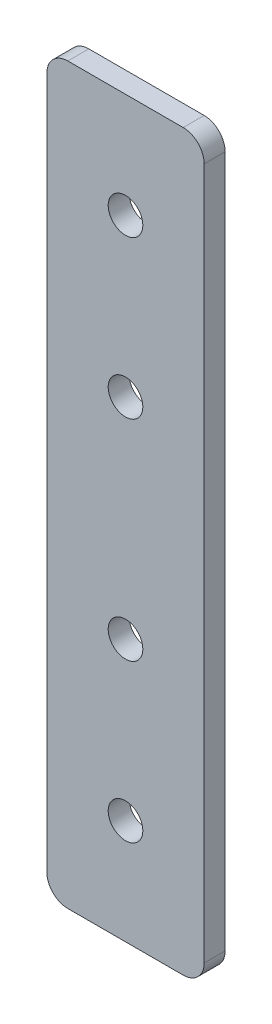
ISO-10303-21;
HEADER;
FILE_DESCRIPTION(('STEP AP214'),'2;1');
FILE_NAME('part.step','',(''),(''),'','','');
FILE_SCHEMA(('AUTOMOTIVE_DESIGN { 1 0 10303 214 1 1 1 1 }'));
ENDSEC;
DATA;
#1=APPLICATION_CONTEXT('core data for automotive mechanical design processes');
#2=APPLICATION_PROTOCOL_DEFINITION('international standard','automotive_design',2000,#1);
#3=PRODUCT_CONTEXT('',#1,'mechanical');
#4=PRODUCT('Part','Part','',(#3));
#5=PRODUCT_RELATED_PRODUCT_CATEGORY('part','',(#4));
#6=PRODUCT_DEFINITION_FORMATION('','',#4);
#7=PRODUCT_DEFINITION_CONTEXT('part definition',#1,'design');
#8=PRODUCT_DEFINITION('design','',#6,#7);
#9=PRODUCT_DEFINITION_SHAPE('','',#8);
#10=(LENGTH_UNIT() NAMED_UNIT(*) SI_UNIT(.MILLI.,.METRE.));
#11=(NAMED_UNIT(*) PLANE_ANGLE_UNIT() SI_UNIT($,.RADIAN.));
#12=(NAMED_UNIT(*) SI_UNIT($,.STERADIAN.) SOLID_ANGLE_UNIT());
#13=UNCERTAINTY_MEASURE_WITH_UNIT(LENGTH_MEASURE(1.E-05),#10,'distance_accuracy_value','');
#14=(GEOMETRIC_REPRESENTATION_CONTEXT(3) GLOBAL_UNCERTAINTY_ASSIGNED_CONTEXT((#13)) GLOBAL_UNIT_ASSIGNED_CONTEXT((#10,
#11,#12)) REPRESENTATION_CONTEXT('',''));
#15=CARTESIAN_POINT('',(0.,0.,0.));
#16=DIRECTION('',(0.,0.,1.));
#17=DIRECTION('',(1.,0.,0.));
#18=AXIS2_PLACEMENT_3D('',#15,#16,#17);
#19=CARTESIAN_POINT('',(7.5,-35.,2.));
#20=DIRECTION('',(-1.,0.,0.));
#21=DIRECTION('',(0.,0.,1.));
#22=AXIS2_PLACEMENT_3D('',#19,#20,#21);
#23=PLANE('',#22);
#24=DIRECTION('',(0.,1.,0.));
#25=VECTOR('',#24,1.);
#26=CARTESIAN_POINT('',(7.5,-35.,2.));
#27=LINE('',#26,#25);
#28=CARTESIAN_POINT('',(7.5,-33.,2.));
#29=VERTEX_POINT('',#28);
#30=CARTESIAN_POINT('',(7.5,33.,2.));
#31=VERTEX_POINT('',#30);
#32=EDGE_CURVE('E129',#29,#31,#27,.T.);
#33=ORIENTED_EDGE('',*,*,#32,.F.);
#34=DIRECTION('',(0.,0.,-1.));
#35=VECTOR('',#34,1.);
#36=CARTESIAN_POINT('',(7.5,-33.,2.));
#37=LINE('',#36,#35);
#38=CARTESIAN_POINT('',(7.5,-33.,0.));
#39=VERTEX_POINT('',#38);
#40=EDGE_CURVE('E155',#29,#39,#37,.T.);
#41=ORIENTED_EDGE('',*,*,#40,.T.);
#42=DIRECTION('',(0.,1.,0.));
#43=VECTOR('',#42,1.);
#44=CARTESIAN_POINT('',(7.5,-35.,0.));
#45=LINE('',#44,#43);
#46=CARTESIAN_POINT('',(7.5,33.,0.));
#47=VERTEX_POINT('',#46);
#48=EDGE_CURVE('E163',#39,#47,#45,.T.);
#49=ORIENTED_EDGE('',*,*,#48,.T.);
#50=DIRECTION('',(0.,0.,-1.));
#51=VECTOR('',#50,1.);
#52=CARTESIAN_POINT('',(7.5,33.,2.));
#53=LINE('',#52,#51);
#54=EDGE_CURVE('E153',#47,#31,#53,.F.);
#55=ORIENTED_EDGE('',*,*,#54,.T.);
#56=EDGE_LOOP('',(#33,#41,#49,#55));
#57=FACE_BOUND('',#56,.T.);
#58=ADVANCED_FACE('F38',(#57),#23,.F.);
#59=CARTESIAN_POINT('',(-7.5,35.,2.));
#60=DIRECTION('',(0.,-1.,0.));
#61=DIRECTION('',(0.,0.,-1.));
#62=AXIS2_PLACEMENT_3D('',#59,#60,#61);
#63=PLANE('',#62);
#64=DIRECTION('',(-1.,0.,0.));
#65=VECTOR('',#64,1.);
#66=CARTESIAN_POINT('',(-7.5,35.,0.));
#67=LINE('',#66,#65);
#68=CARTESIAN_POINT('',(5.5,35.,0.));
#69=VERTEX_POINT('',#68);
#70=CARTESIAN_POINT('',(-5.5,35.,0.));
#71=VERTEX_POINT('',#70);
#72=EDGE_CURVE('E134',#69,#71,#67,.T.);
#73=ORIENTED_EDGE('',*,*,#72,.T.);
#74=DIRECTION('',(0.,0.,-1.));
#75=VECTOR('',#74,1.);
#76=CARTESIAN_POINT('',(-5.5,35.,2.));
#77=LINE('',#76,#75);
#78=CARTESIAN_POINT('',(-5.5,35.,2.));
#79=VERTEX_POINT('',#78);
#80=EDGE_CURVE('E11',#71,#79,#77,.F.);
#81=ORIENTED_EDGE('',*,*,#80,.T.);
#82=DIRECTION('',(-1.,0.,0.));
#83=VECTOR('',#82,1.);
#84=CARTESIAN_POINT('',(-7.5,35.,2.));
#85=LINE('',#84,#83);
#86=CARTESIAN_POINT('',(5.5,35.,2.));
#87=VERTEX_POINT('',#86);
#88=EDGE_CURVE('E132',#87,#79,#85,.T.);
#89=ORIENTED_EDGE('',*,*,#88,.F.);
#90=DIRECTION('',(0.,0.,-1.));
#91=VECTOR('',#90,1.);
#92=CARTESIAN_POINT('',(5.5,35.,2.));
#93=LINE('',#92,#91);
#94=EDGE_CURVE('E46',#87,#69,#93,.T.);
#95=ORIENTED_EDGE('',*,*,#94,.T.);
#96=EDGE_LOOP('',(#73,#81,#89,#95));
#97=FACE_BOUND('',#96,.T.);
#98=ADVANCED_FACE('F160',(#97),#63,.F.);
#99=CARTESIAN_POINT('',(-7.5,-35.,2.));
#100=DIRECTION('',(1.,0.,0.));
#101=DIRECTION('',(0.,0.,-1.));
#102=AXIS2_PLACEMENT_3D('',#99,#100,#101);
#103=PLANE('',#102);
#104=DIRECTION('',(0.,-1.,0.));
#105=VECTOR('',#104,1.);
#106=CARTESIAN_POINT('',(-7.5,-35.,0.));
#107=LINE('',#106,#105);
#108=CARTESIAN_POINT('',(-7.5,33.,0.));
#109=VERTEX_POINT('',#108);
#110=CARTESIAN_POINT('',(-7.5,-33.,0.));
#111=VERTEX_POINT('',#110);
#112=EDGE_CURVE('E130',#109,#111,#107,.T.);
#113=ORIENTED_EDGE('',*,*,#112,.T.);
#114=DIRECTION('',(0.,0.,-1.));
#115=VECTOR('',#114,1.);
#116=CARTESIAN_POINT('',(-7.5,-33.,2.));
#117=LINE('',#116,#115);
#118=CARTESIAN_POINT('',(-7.5,-33.,2.));
#119=VERTEX_POINT('',#118);
#120=EDGE_CURVE('E108',#111,#119,#117,.F.);
#121=ORIENTED_EDGE('',*,*,#120,.T.);
#122=DIRECTION('',(0.,-1.,0.));
#123=VECTOR('',#122,1.);
#124=CARTESIAN_POINT('',(-7.5,-35.,2.));
#125=LINE('',#124,#123);
#126=CARTESIAN_POINT('',(-7.5,33.,2.));
#127=VERTEX_POINT('',#126);
#128=EDGE_CURVE('E168',#127,#119,#125,.T.);
#129=ORIENTED_EDGE('',*,*,#128,.F.);
#130=DIRECTION('',(0.,0.,-1.));
#131=VECTOR('',#130,1.);
#132=CARTESIAN_POINT('',(-7.5,33.,2.));
#133=LINE('',#132,#131);
#134=EDGE_CURVE('E113',#127,#109,#133,.T.);
#135=ORIENTED_EDGE('',*,*,#134,.T.);
#136=EDGE_LOOP('',(#113,#121,#129,#135));
#137=FACE_BOUND('',#136,.T.);
#138=ADVANCED_FACE('F211',(#137),#103,.F.);
#139=CARTESIAN_POINT('',(-7.5,-35.,2.));
#140=DIRECTION('',(0.,1.,0.));
#141=DIRECTION('',(0.,0.,1.));
#142=AXIS2_PLACEMENT_3D('',#139,#140,#141);
#143=PLANE('',#142);
#144=DIRECTION('',(1.,0.,0.));
#145=VECTOR('',#144,1.);
#146=CARTESIAN_POINT('',(-7.5,-35.,2.));
#147=LINE('',#146,#145);
#148=CARTESIAN_POINT('',(-5.5,-35.,2.));
#149=VERTEX_POINT('',#148);
#150=CARTESIAN_POINT('',(5.5,-35.,2.));
#151=VERTEX_POINT('',#150);
#152=EDGE_CURVE('E123',#149,#151,#147,.T.);
#153=ORIENTED_EDGE('',*,*,#152,.F.);
#154=DIRECTION('',(0.,0.,-1.));
#155=VECTOR('',#154,1.);
#156=CARTESIAN_POINT('',(-5.5,-35.,2.));
#157=LINE('',#156,#155);
#158=CARTESIAN_POINT('',(-5.5,-35.,0.));
#159=VERTEX_POINT('',#158);
#160=EDGE_CURVE('E107',#149,#159,#157,.T.);
#161=ORIENTED_EDGE('',*,*,#160,.T.);
#162=DIRECTION('',(1.,0.,0.));
#163=VECTOR('',#162,1.);
#164=CARTESIAN_POINT('',(-7.5,-35.,0.));
#165=LINE('',#164,#163);
#166=CARTESIAN_POINT('',(5.5,-35.,0.));
#167=VERTEX_POINT('',#166);
#168=EDGE_CURVE('E120',#159,#167,#165,.T.);
#169=ORIENTED_EDGE('',*,*,#168,.T.);
#170=DIRECTION('',(0.,0.,-1.));
#171=VECTOR('',#170,1.);
#172=CARTESIAN_POINT('',(5.5,-35.,2.));
#173=LINE('',#172,#171);
#174=EDGE_CURVE('E125',#167,#151,#173,.F.);
#175=ORIENTED_EDGE('',*,*,#174,.T.);
#176=EDGE_LOOP('',(#153,#161,#169,#175));
#177=FACE_BOUND('',#176,.T.);
#178=ADVANCED_FACE('F119',(#177),#143,.F.);
#179=CARTESIAN_POINT('',(0.,0.,2.));
#180=DIRECTION('',(0.,0.,-1.));
#181=DIRECTION('',(-1.,0.,0.));
#182=AXIS2_PLACEMENT_3D('',#179,#180,#181);
#183=PLANE('',#182);
#184=CARTESIAN_POINT('',(0.,-25.,2.));
#185=DIRECTION('',(0.,0.,1.));
#186=DIRECTION('',(1.,0.,0.));
#187=AXIS2_PLACEMENT_3D('',#184,#185,#186);
#188=CIRCLE('',#187,1.65);
#189=CARTESIAN_POINT('',(1.65000000000001,-25.,2.));
#190=VERTEX_POINT('',#189);
#191=EDGE_CURVE('E192',#190,#190,#188,.T.);
#192=ORIENTED_EDGE('',*,*,#191,.F.);
#193=EDGE_LOOP('',(#192));
#194=FACE_BOUND('',#193,.T.);
#195=CARTESIAN_POINT('',(0.,-10.,2.));
#196=DIRECTION('',(0.,0.,1.));
#197=DIRECTION('',(1.,0.,0.));
#198=AXIS2_PLACEMENT_3D('',#195,#196,#197);
#199=CIRCLE('',#198,1.65);
#200=CARTESIAN_POINT('',(1.65,-10.,2.));
#201=VERTEX_POINT('',#200);
#202=EDGE_CURVE('E186',#201,#201,#199,.T.);
#203=ORIENTED_EDGE('',*,*,#202,.F.);
#204=EDGE_LOOP('',(#203));
#205=FACE_BOUND('',#204,.T.);
#206=CARTESIAN_POINT('',(0.,10.,2.));
#207=DIRECTION('',(0.,0.,1.));
#208=DIRECTION('',(1.,0.,0.));
#209=AXIS2_PLACEMENT_3D('',#206,#207,#208);
#210=CIRCLE('',#209,1.65);
#211=CARTESIAN_POINT('',(1.65,10.,2.));
#212=VERTEX_POINT('',#211);
#213=EDGE_CURVE('E180',#212,#212,#210,.T.);
#214=ORIENTED_EDGE('',*,*,#213,.F.);
#215=EDGE_LOOP('',(#214));
#216=FACE_BOUND('',#215,.T.);
#217=CARTESIAN_POINT('',(0.,25.,2.));
#218=DIRECTION('',(0.,0.,1.));
#219=DIRECTION('',(1.,0.,0.));
#220=AXIS2_PLACEMENT_3D('',#217,#218,#219);
#221=CIRCLE('',#220,1.65);
#222=CARTESIAN_POINT('',(1.65,25.,2.));
#223=VERTEX_POINT('',#222);
#224=EDGE_CURVE('E174',#223,#223,#221,.T.);
#225=ORIENTED_EDGE('',*,*,#224,.F.);
#226=EDGE_LOOP('',(#225));
#227=FACE_BOUND('',#226,.T.);
#228=ORIENTED_EDGE('',*,*,#128,.T.);
#229=CARTESIAN_POINT('',(-5.5,-33.,2.));
#230=DIRECTION('',(0.,0.,-1.));
#231=DIRECTION('',(-1.,0.,0.));
#232=AXIS2_PLACEMENT_3D('',#229,#230,#231);
#233=CIRCLE('',#232,2.);
#234=EDGE_CURVE('E151',#119,#149,#233,.F.);
#235=ORIENTED_EDGE('',*,*,#234,.T.);
#236=ORIENTED_EDGE('',*,*,#152,.T.);
#237=CARTESIAN_POINT('',(5.5,-33.,2.));
#238=DIRECTION('',(0.,0.,-1.));
#239=DIRECTION('',(-1.,0.,0.));
#240=AXIS2_PLACEMENT_3D('',#237,#238,#239);
#241=CIRCLE('',#240,2.);
#242=EDGE_CURVE('E149',#151,#29,#241,.F.);
#243=ORIENTED_EDGE('',*,*,#242,.T.);
#244=ORIENTED_EDGE('',*,*,#32,.T.);
#245=CARTESIAN_POINT('',(5.5,33.,2.));
#246=DIRECTION('',(0.,0.,-1.));
#247=DIRECTION('',(-1.,0.,0.));
#248=AXIS2_PLACEMENT_3D('',#245,#246,#247);
#249=CIRCLE('',#248,2.);
#250=EDGE_CURVE('E58',#31,#87,#249,.F.);
#251=ORIENTED_EDGE('',*,*,#250,.T.);
#252=ORIENTED_EDGE('',*,*,#88,.T.);
#253=CARTESIAN_POINT('',(-5.5,33.,2.));
#254=DIRECTION('',(0.,0.,-1.));
#255=DIRECTION('',(-1.,0.,0.));
#256=AXIS2_PLACEMENT_3D('',#253,#254,#255);
#257=CIRCLE('',#256,2.);
#258=EDGE_CURVE('E147',#79,#127,#257,.F.);
#259=ORIENTED_EDGE('',*,*,#258,.T.);
#260=EDGE_LOOP('',(#228,#235,#236,#243,#244,#251,#252,#259));
#261=FACE_BOUND('',#260,.T.);
#262=ADVANCED_FACE('F198',(#194,#205,#216,#227,#261),#183,.F.);
#263=CARTESIAN_POINT('',(0.,0.,0.));
#264=DIRECTION('',(0.,0.,-1.));
#265=DIRECTION('',(-1.,0.,0.));
#266=AXIS2_PLACEMENT_3D('',#263,#264,#265);
#267=PLANE('',#266);
#268=CARTESIAN_POINT('',(0.,-25.,0.));
#269=DIRECTION('',(0.,0.,-1.));
#270=DIRECTION('',(-1.,0.,0.));
#271=AXIS2_PLACEMENT_3D('',#268,#269,#270);
#272=CIRCLE('',#271,1.65);
#273=CARTESIAN_POINT('',(-1.64999999999999,-25.,0.));
#274=VERTEX_POINT('',#273);
#275=EDGE_CURVE('E189',#274,#274,#272,.T.);
#276=ORIENTED_EDGE('',*,*,#275,.F.);
#277=EDGE_LOOP('',(#276));
#278=FACE_BOUND('',#277,.T.);
#279=CARTESIAN_POINT('',(0.,-10.,0.));
#280=DIRECTION('',(0.,0.,-1.));
#281=DIRECTION('',(-1.,0.,0.));
#282=AXIS2_PLACEMENT_3D('',#279,#280,#281);
#283=CIRCLE('',#282,1.65);
#284=CARTESIAN_POINT('',(-1.64999999999999,-10.,0.));
#285=VERTEX_POINT('',#284);
#286=EDGE_CURVE('E183',#285,#285,#283,.T.);
#287=ORIENTED_EDGE('',*,*,#286,.F.);
#288=EDGE_LOOP('',(#287));
#289=FACE_BOUND('',#288,.T.);
#290=CARTESIAN_POINT('',(0.,10.,0.));
#291=DIRECTION('',(0.,0.,-1.));
#292=DIRECTION('',(-1.,0.,0.));
#293=AXIS2_PLACEMENT_3D('',#290,#291,#292);
#294=CIRCLE('',#293,1.65);
#295=CARTESIAN_POINT('',(-1.65,10.,0.));
#296=VERTEX_POINT('',#295);
#297=EDGE_CURVE('E177',#296,#296,#294,.T.);
#298=ORIENTED_EDGE('',*,*,#297,.F.);
#299=EDGE_LOOP('',(#298));
#300=FACE_BOUND('',#299,.T.);
#301=CARTESIAN_POINT('',(0.,25.,0.));
#302=DIRECTION('',(0.,0.,-1.));
#303=DIRECTION('',(-1.,0.,0.));
#304=AXIS2_PLACEMENT_3D('',#301,#302,#303);
#305=CIRCLE('',#304,1.65);
#306=CARTESIAN_POINT('',(-1.65,25.,0.));
#307=VERTEX_POINT('',#306);
#308=EDGE_CURVE('E164',#307,#307,#305,.T.);
#309=ORIENTED_EDGE('',*,*,#308,.F.);
#310=EDGE_LOOP('',(#309));
#311=FACE_BOUND('',#310,.T.);
#312=ORIENTED_EDGE('',*,*,#168,.F.);
#313=CARTESIAN_POINT('',(-5.5,-33.,0.));
#314=DIRECTION('',(0.,0.,-1.));
#315=DIRECTION('',(-1.,0.,0.));
#316=AXIS2_PLACEMENT_3D('',#313,#314,#315);
#317=CIRCLE('',#316,2.);
#318=EDGE_CURVE('E103',#159,#111,#317,.T.);
#319=ORIENTED_EDGE('',*,*,#318,.T.);
#320=ORIENTED_EDGE('',*,*,#112,.F.);
#321=CARTESIAN_POINT('',(-5.5,33.,0.));
#322=DIRECTION('',(0.,0.,-1.));
#323=DIRECTION('',(-1.,0.,0.));
#324=AXIS2_PLACEMENT_3D('',#321,#322,#323);
#325=CIRCLE('',#324,2.);
#326=EDGE_CURVE('E140',#109,#71,#325,.T.);
#327=ORIENTED_EDGE('',*,*,#326,.T.);
#328=ORIENTED_EDGE('',*,*,#72,.F.);
#329=CARTESIAN_POINT('',(5.5,33.,0.));
#330=DIRECTION('',(0.,0.,-1.));
#331=DIRECTION('',(-1.,0.,0.));
#332=AXIS2_PLACEMENT_3D('',#329,#330,#331);
#333=CIRCLE('',#332,2.);
#334=EDGE_CURVE('E124',#69,#47,#333,.T.);
#335=ORIENTED_EDGE('',*,*,#334,.T.);
#336=ORIENTED_EDGE('',*,*,#48,.F.);
#337=CARTESIAN_POINT('',(5.5,-33.,0.));
#338=DIRECTION('',(0.,0.,-1.));
#339=DIRECTION('',(-1.,0.,0.));
#340=AXIS2_PLACEMENT_3D('',#337,#338,#339);
#341=CIRCLE('',#340,2.);
#342=EDGE_CURVE('E114',#39,#167,#341,.T.);
#343=ORIENTED_EDGE('',*,*,#342,.T.);
#344=EDGE_LOOP('',(#312,#319,#320,#327,#328,#335,#336,#343));
#345=FACE_BOUND('',#344,.T.);
#346=ADVANCED_FACE('F127',(#278,#289,#300,#311,#345),#267,.T.);
#347=CARTESIAN_POINT('',(0.,25.,2.));
#348=DIRECTION('',(0.,0.,1.));
#349=DIRECTION('',(1.,0.,0.));
#350=AXIS2_PLACEMENT_3D('',#347,#348,#349);
#351=CYLINDRICAL_SURFACE('',#350,1.65);
#352=ORIENTED_EDGE('',*,*,#308,.T.);
#353=EDGE_LOOP('',(#352));
#354=FACE_BOUND('',#353,.T.);
#355=ORIENTED_EDGE('',*,*,#224,.T.);
#356=EDGE_LOOP('',(#355));
#357=FACE_BOUND('',#356,.T.);
#358=ADVANCED_FACE('F248',(#354,#357),#351,.F.);
#359=CARTESIAN_POINT('',(0.,10.,2.));
#360=DIRECTION('',(0.,0.,1.));
#361=DIRECTION('',(1.,0.,0.));
#362=AXIS2_PLACEMENT_3D('',#359,#360,#361);
#363=CYLINDRICAL_SURFACE('',#362,1.65);
#364=ORIENTED_EDGE('',*,*,#297,.T.);
#365=EDGE_LOOP('',(#364));
#366=FACE_BOUND('',#365,.T.);
#367=ORIENTED_EDGE('',*,*,#213,.T.);
#368=EDGE_LOOP('',(#367));
#369=FACE_BOUND('',#368,.T.);
#370=ADVANCED_FACE('F242',(#366,#369),#363,.F.);
#371=CARTESIAN_POINT('',(0.,-10.,2.));
#372=DIRECTION('',(0.,0.,1.));
#373=DIRECTION('',(1.,0.,0.));
#374=AXIS2_PLACEMENT_3D('',#371,#372,#373);
#375=CYLINDRICAL_SURFACE('',#374,1.65);
#376=ORIENTED_EDGE('',*,*,#286,.T.);
#377=EDGE_LOOP('',(#376));
#378=FACE_BOUND('',#377,.T.);
#379=ORIENTED_EDGE('',*,*,#202,.T.);
#380=EDGE_LOOP('',(#379));
#381=FACE_BOUND('',#380,.T.);
#382=ADVANCED_FACE('F236',(#378,#381),#375,.F.);
#383=CARTESIAN_POINT('',(0.,-25.,2.));
#384=DIRECTION('',(0.,0.,1.));
#385=DIRECTION('',(1.,0.,0.));
#386=AXIS2_PLACEMENT_3D('',#383,#384,#385);
#387=CYLINDRICAL_SURFACE('',#386,1.65);
#388=ORIENTED_EDGE('',*,*,#275,.T.);
#389=EDGE_LOOP('',(#388));
#390=FACE_BOUND('',#389,.T.);
#391=ORIENTED_EDGE('',*,*,#191,.T.);
#392=EDGE_LOOP('',(#391));
#393=FACE_BOUND('',#392,.T.);
#394=ADVANCED_FACE('F196',(#390,#393),#387,.F.);
#395=CARTESIAN_POINT('',(-5.5,-33.,2.));
#396=DIRECTION('',(0.,0.,-1.));
#397=DIRECTION('',(-1.,0.,0.));
#398=AXIS2_PLACEMENT_3D('',#395,#396,#397);
#399=CYLINDRICAL_SURFACE('',#398,2.);
#400=ORIENTED_EDGE('',*,*,#234,.F.);
#401=ORIENTED_EDGE('',*,*,#120,.F.);
#402=ORIENTED_EDGE('',*,*,#318,.F.);
#403=ORIENTED_EDGE('',*,*,#160,.F.);
#404=EDGE_LOOP('',(#400,#401,#402,#403));
#405=FACE_BOUND('',#404,.T.);
#406=ADVANCED_FACE('F106',(#405),#399,.T.);
#407=CARTESIAN_POINT('',(5.5,-33.,2.));
#408=DIRECTION('',(0.,0.,-1.));
#409=DIRECTION('',(-1.,0.,0.));
#410=AXIS2_PLACEMENT_3D('',#407,#408,#409);
#411=CYLINDRICAL_SURFACE('',#410,2.);
#412=ORIENTED_EDGE('',*,*,#242,.F.);
#413=ORIENTED_EDGE('',*,*,#174,.F.);
#414=ORIENTED_EDGE('',*,*,#342,.F.);
#415=ORIENTED_EDGE('',*,*,#40,.F.);
#416=EDGE_LOOP('',(#412,#413,#414,#415));
#417=FACE_BOUND('',#416,.T.);
#418=ADVANCED_FACE('F215',(#417),#411,.T.);
#419=CARTESIAN_POINT('',(-5.5,33.,2.));
#420=DIRECTION('',(0.,0.,-1.));
#421=DIRECTION('',(-1.,0.,0.));
#422=AXIS2_PLACEMENT_3D('',#419,#420,#421);
#423=CYLINDRICAL_SURFACE('',#422,2.);
#424=ORIENTED_EDGE('',*,*,#258,.F.);
#425=ORIENTED_EDGE('',*,*,#80,.F.);
#426=ORIENTED_EDGE('',*,*,#326,.F.);
#427=ORIENTED_EDGE('',*,*,#134,.F.);
#428=EDGE_LOOP('',(#424,#425,#426,#427));
#429=FACE_BOUND('',#428,.T.);
#430=ADVANCED_FACE('F213',(#429),#423,.T.);
#431=CARTESIAN_POINT('',(5.5,33.,2.));
#432=DIRECTION('',(0.,0.,-1.));
#433=DIRECTION('',(-1.,0.,0.));
#434=AXIS2_PLACEMENT_3D('',#431,#432,#433);
#435=CYLINDRICAL_SURFACE('',#434,2.);
#436=ORIENTED_EDGE('',*,*,#250,.F.);
#437=ORIENTED_EDGE('',*,*,#54,.F.);
#438=ORIENTED_EDGE('',*,*,#334,.F.);
#439=ORIENTED_EDGE('',*,*,#94,.F.);
#440=EDGE_LOOP('',(#436,#437,#438,#439));
#441=FACE_BOUND('',#440,.T.);
#442=ADVANCED_FACE('F40',(#441),#435,.T.);
#443=CLOSED_SHELL('',(#58,#98,#138,#178,#262,#346,#358,#370,#382,#394,#406,#418,#430,#442));
#444=MANIFOLD_SOLID_BREP('B2',#443);
#445=ADVANCED_BREP_SHAPE_REPRESENTATION('',(#18,#444),#14);
#446=SHAPE_DEFINITION_REPRESENTATION(#9,#445);
ENDSEC;
END-ISO-10303-21;
